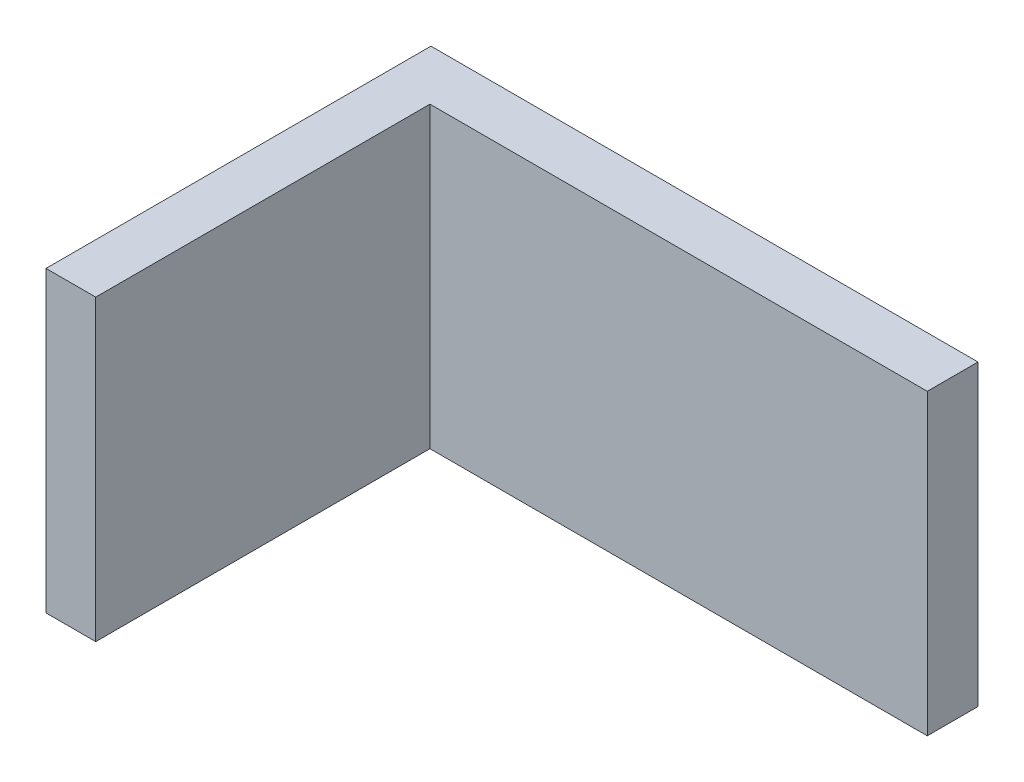
ISO-10303-21;
HEADER;
FILE_DESCRIPTION(('STEP AP214'),'2;1');
FILE_NAME('part.step','',(''),(''),'','','');
FILE_SCHEMA(('AUTOMOTIVE_DESIGN { 1 0 10303 214 1 1 1 1 }'));
ENDSEC;
DATA;
#1=APPLICATION_CONTEXT('core data for automotive mechanical design processes');
#2=APPLICATION_PROTOCOL_DEFINITION('international standard','automotive_design',2000,#1);
#3=PRODUCT_CONTEXT('',#1,'mechanical');
#4=PRODUCT('Part','Part','',(#3));
#5=PRODUCT_RELATED_PRODUCT_CATEGORY('part','',(#4));
#6=PRODUCT_DEFINITION_FORMATION('','',#4);
#7=PRODUCT_DEFINITION_CONTEXT('part definition',#1,'design');
#8=PRODUCT_DEFINITION('design','',#6,#7);
#9=PRODUCT_DEFINITION_SHAPE('','',#8);
#10=(LENGTH_UNIT() NAMED_UNIT(*) SI_UNIT(.MILLI.,.METRE.));
#11=(NAMED_UNIT(*) PLANE_ANGLE_UNIT() SI_UNIT($,.RADIAN.));
#12=(NAMED_UNIT(*) SI_UNIT($,.STERADIAN.) SOLID_ANGLE_UNIT());
#13=UNCERTAINTY_MEASURE_WITH_UNIT(LENGTH_MEASURE(1.E-05),#10,'distance_accuracy_value','');
#14=(GEOMETRIC_REPRESENTATION_CONTEXT(3) GLOBAL_UNCERTAINTY_ASSIGNED_CONTEXT((#13)) GLOBAL_UNIT_ASSIGNED_CONTEXT((#10,
#11,#12)) REPRESENTATION_CONTEXT('',''));
#15=CARTESIAN_POINT('',(0.,0.,0.));
#16=DIRECTION('',(0.,0.,1.));
#17=DIRECTION('',(1.,0.,0.));
#18=AXIS2_PLACEMENT_3D('',#15,#16,#17);
#19=CARTESIAN_POINT('',(-4.55,2.1,0.));
#20=DIRECTION('',(0.,-1.,0.));
#21=DIRECTION('',(0.,0.,1.));
#22=AXIS2_PLACEMENT_3D('',#19,#20,#21);
#23=PLANE('',#22);
#24=DIRECTION('',(-1.,0.,0.));
#25=VECTOR('',#24,1.);
#26=CARTESIAN_POINT('',(-4.,2.1,0.));
#27=LINE('',#26,#25);
#28=CARTESIAN_POINT('',(-4.,2.1,0.));
#29=VERTEX_POINT('',#28);
#30=CARTESIAN_POINT('',(-4.55,2.1,0.));
#31=VERTEX_POINT('',#30);
#32=EDGE_CURVE('E11',#29,#31,#27,.T.);
#33=ORIENTED_EDGE('',*,*,#32,.F.);
#34=DIRECTION('',(0.,0.,-1.));
#35=VECTOR('',#34,1.);
#36=CARTESIAN_POINT('',(-4.,2.1,0.051));
#37=LINE('',#36,#35);
#38=CARTESIAN_POINT('',(-4.,2.1,0.051));
#39=VERTEX_POINT('',#38);
#40=EDGE_CURVE('E24',#39,#29,#37,.T.);
#41=ORIENTED_EDGE('',*,*,#40,.F.);
#42=DIRECTION('',(1.,0.,0.));
#43=VECTOR('',#42,1.);
#44=CARTESIAN_POINT('',(-4.5,2.1,0.051));
#45=LINE('',#44,#43);
#46=CARTESIAN_POINT('',(-4.5,2.1,0.051));
#47=VERTEX_POINT('',#46);
#48=EDGE_CURVE('E87',#47,#39,#45,.T.);
#49=ORIENTED_EDGE('',*,*,#48,.F.);
#50=DIRECTION('',(0.,0.,-1.));
#51=VECTOR('',#50,1.);
#52=CARTESIAN_POINT('',(-4.5,2.1,0.387));
#53=LINE('',#52,#51);
#54=CARTESIAN_POINT('',(-4.5,2.1,0.387));
#55=VERTEX_POINT('',#54);
#56=EDGE_CURVE('E114',#55,#47,#53,.T.);
#57=ORIENTED_EDGE('',*,*,#56,.F.);
#58=DIRECTION('',(1.,0.,0.));
#59=VECTOR('',#58,1.);
#60=CARTESIAN_POINT('',(-4.55,2.1,0.387));
#61=LINE('',#60,#59);
#62=CARTESIAN_POINT('',(-4.55,2.1,0.387));
#63=VERTEX_POINT('',#62);
#64=EDGE_CURVE('E111',#63,#55,#61,.T.);
#65=ORIENTED_EDGE('',*,*,#64,.F.);
#66=DIRECTION('',(0.,0.,1.));
#67=VECTOR('',#66,1.);
#68=CARTESIAN_POINT('',(-4.55,2.1,0.));
#69=LINE('',#68,#67);
#70=EDGE_CURVE('E108',#31,#63,#69,.T.);
#71=ORIENTED_EDGE('',*,*,#70,.F.);
#72=EDGE_LOOP('',(#33,#41,#49,#57,#65,#71));
#73=FACE_BOUND('',#72,.T.);
#74=ADVANCED_FACE('F17',(#73),#23,.T.);
#75=CARTESIAN_POINT('',(-4.,2.4,0.));
#76=DIRECTION('',(0.,1.,0.));
#77=DIRECTION('',(0.,0.,1.));
#78=AXIS2_PLACEMENT_3D('',#75,#76,#77);
#79=PLANE('',#78);
#80=DIRECTION('',(1.,0.,0.));
#81=VECTOR('',#80,1.);
#82=CARTESIAN_POINT('',(-4.55,2.4,0.));
#83=LINE('',#82,#81);
#84=CARTESIAN_POINT('',(-4.55,2.4,0.));
#85=VERTEX_POINT('',#84);
#86=CARTESIAN_POINT('',(-4.,2.4,0.));
#87=VERTEX_POINT('',#86);
#88=EDGE_CURVE('E106',#85,#87,#83,.T.);
#89=ORIENTED_EDGE('',*,*,#88,.F.);
#90=DIRECTION('',(0.,0.,-1.));
#91=VECTOR('',#90,1.);
#92=CARTESIAN_POINT('',(-4.55,2.4,0.387));
#93=LINE('',#92,#91);
#94=CARTESIAN_POINT('',(-4.55,2.4,0.387));
#95=VERTEX_POINT('',#94);
#96=EDGE_CURVE('E103',#95,#85,#93,.T.);
#97=ORIENTED_EDGE('',*,*,#96,.F.);
#98=DIRECTION('',(-1.,0.,0.));
#99=VECTOR('',#98,1.);
#100=CARTESIAN_POINT('',(-4.5,2.4,0.387));
#101=LINE('',#100,#99);
#102=CARTESIAN_POINT('',(-4.5,2.4,0.387));
#103=VERTEX_POINT('',#102);
#104=EDGE_CURVE('E100',#103,#95,#101,.T.);
#105=ORIENTED_EDGE('',*,*,#104,.F.);
#106=DIRECTION('',(0.,0.,1.));
#107=VECTOR('',#106,1.);
#108=CARTESIAN_POINT('',(-4.5,2.4,0.051));
#109=LINE('',#108,#107);
#110=CARTESIAN_POINT('',(-4.5,2.4,0.051));
#111=VERTEX_POINT('',#110);
#112=EDGE_CURVE('E72',#111,#103,#109,.T.);
#113=ORIENTED_EDGE('',*,*,#112,.F.);
#114=DIRECTION('',(-1.,0.,0.));
#115=VECTOR('',#114,1.);
#116=CARTESIAN_POINT('',(-4.,2.4,0.051));
#117=LINE('',#116,#115);
#118=CARTESIAN_POINT('',(-4.,2.4,0.051));
#119=VERTEX_POINT('',#118);
#120=EDGE_CURVE('E66',#119,#111,#117,.T.);
#121=ORIENTED_EDGE('',*,*,#120,.F.);
#122=DIRECTION('',(0.,0.,1.));
#123=VECTOR('',#122,1.);
#124=CARTESIAN_POINT('',(-4.,2.4,0.));
#125=LINE('',#124,#123);
#126=EDGE_CURVE('E69',#87,#119,#125,.T.);
#127=ORIENTED_EDGE('',*,*,#126,.F.);
#128=EDGE_LOOP('',(#89,#97,#105,#113,#121,#127));
#129=FACE_BOUND('',#128,.T.);
#130=ADVANCED_FACE('F68',(#129),#79,.T.);
#131=CARTESIAN_POINT('',(-4.55,2.1,0.387));
#132=DIRECTION('',(0.,0.,1.));
#133=DIRECTION('',(0.,1.,0.));
#134=AXIS2_PLACEMENT_3D('',#131,#132,#133);
#135=PLANE('',#134);
#136=ORIENTED_EDGE('',*,*,#64,.T.);
#137=DIRECTION('',(0.,-1.,0.));
#138=VECTOR('',#137,1.);
#139=CARTESIAN_POINT('',(-4.5,2.4,0.387));
#140=LINE('',#139,#138);
#141=EDGE_CURVE('E83',#103,#55,#140,.T.);
#142=ORIENTED_EDGE('',*,*,#141,.F.);
#143=ORIENTED_EDGE('',*,*,#104,.T.);
#144=DIRECTION('',(0.,1.,0.));
#145=VECTOR('',#144,1.);
#146=CARTESIAN_POINT('',(-4.55,2.1,0.387));
#147=LINE('',#146,#145);
#148=EDGE_CURVE('E88',#63,#95,#147,.T.);
#149=ORIENTED_EDGE('',*,*,#148,.F.);
#150=EDGE_LOOP('',(#136,#142,#143,#149));
#151=FACE_BOUND('',#150,.T.);
#152=ADVANCED_FACE('F125',(#151),#135,.T.);
#153=CARTESIAN_POINT('',(-4.5,2.1,0.051));
#154=DIRECTION('',(0.,0.,1.));
#155=DIRECTION('',(0.,1.,0.));
#156=AXIS2_PLACEMENT_3D('',#153,#154,#155);
#157=PLANE('',#156);
#158=ORIENTED_EDGE('',*,*,#48,.T.);
#159=DIRECTION('',(0.,-1.,0.));
#160=VECTOR('',#159,1.);
#161=CARTESIAN_POINT('',(-4.,2.4,0.051));
#162=LINE('',#161,#160);
#163=EDGE_CURVE('E81',#119,#39,#162,.T.);
#164=ORIENTED_EDGE('',*,*,#163,.F.);
#165=ORIENTED_EDGE('',*,*,#120,.T.);
#166=DIRECTION('',(0.,1.,0.));
#167=VECTOR('',#166,1.);
#168=CARTESIAN_POINT('',(-4.5,2.1,0.051));
#169=LINE('',#168,#167);
#170=EDGE_CURVE('E89',#47,#111,#169,.T.);
#171=ORIENTED_EDGE('',*,*,#170,.F.);
#172=EDGE_LOOP('',(#158,#164,#165,#171));
#173=FACE_BOUND('',#172,.T.);
#174=ADVANCED_FACE('F86',(#173),#157,.T.);
#175=CARTESIAN_POINT('',(-4.55,2.4,0.));
#176=DIRECTION('',(-1.,0.,0.));
#177=DIRECTION('',(0.,0.,1.));
#178=AXIS2_PLACEMENT_3D('',#175,#176,#177);
#179=PLANE('',#178);
#180=DIRECTION('',(0.,1.,0.));
#181=VECTOR('',#180,1.);
#182=CARTESIAN_POINT('',(-4.55,2.1,0.));
#183=LINE('',#182,#181);
#184=EDGE_CURVE('E93',#31,#85,#183,.T.);
#185=ORIENTED_EDGE('',*,*,#184,.F.);
#186=ORIENTED_EDGE('',*,*,#70,.T.);
#187=ORIENTED_EDGE('',*,*,#148,.T.);
#188=ORIENTED_EDGE('',*,*,#96,.T.);
#189=EDGE_LOOP('',(#185,#186,#187,#188));
#190=FACE_BOUND('',#189,.T.);
#191=ADVANCED_FACE('F121',(#190),#179,.T.);
#192=CARTESIAN_POINT('',(-4.,2.1,0.));
#193=DIRECTION('',(1.,0.,0.));
#194=DIRECTION('',(0.,0.,1.));
#195=AXIS2_PLACEMENT_3D('',#192,#193,#194);
#196=PLANE('',#195);
#197=DIRECTION('',(0.,-1.,0.));
#198=VECTOR('',#197,1.);
#199=CARTESIAN_POINT('',(-4.,2.4,0.));
#200=LINE('',#199,#198);
#201=EDGE_CURVE('E82',#87,#29,#200,.T.);
#202=ORIENTED_EDGE('',*,*,#201,.F.);
#203=ORIENTED_EDGE('',*,*,#126,.T.);
#204=ORIENTED_EDGE('',*,*,#163,.T.);
#205=ORIENTED_EDGE('',*,*,#40,.T.);
#206=EDGE_LOOP('',(#202,#203,#204,#205));
#207=FACE_BOUND('',#206,.T.);
#208=ADVANCED_FACE('F80',(#207),#196,.T.);
#209=CARTESIAN_POINT('',(-4.5,2.1,0.051));
#210=DIRECTION('',(1.,0.,0.));
#211=DIRECTION('',(0.,0.,1.));
#212=AXIS2_PLACEMENT_3D('',#209,#210,#211);
#213=PLANE('',#212);
#214=ORIENTED_EDGE('',*,*,#170,.T.);
#215=ORIENTED_EDGE('',*,*,#112,.T.);
#216=ORIENTED_EDGE('',*,*,#141,.T.);
#217=ORIENTED_EDGE('',*,*,#56,.T.);
#218=EDGE_LOOP('',(#214,#215,#216,#217));
#219=FACE_BOUND('',#218,.T.);
#220=ADVANCED_FACE('F127',(#219),#213,.T.);
#221=CARTESIAN_POINT('',(-4.55,2.4,0.));
#222=DIRECTION('',(0.,0.,-1.));
#223=DIRECTION('',(0.,1.,0.));
#224=AXIS2_PLACEMENT_3D('',#221,#222,#223);
#225=PLANE('',#224);
#226=ORIENTED_EDGE('',*,*,#88,.T.);
#227=ORIENTED_EDGE('',*,*,#201,.T.);
#228=ORIENTED_EDGE('',*,*,#32,.T.);
#229=ORIENTED_EDGE('',*,*,#184,.T.);
#230=EDGE_LOOP('',(#226,#227,#228,#229));
#231=FACE_BOUND('',#230,.T.);
#232=ADVANCED_FACE('F117',(#231),#225,.T.);
#233=CLOSED_SHELL('',(#74,#130,#152,#174,#191,#208,#220,#232));
#234=MANIFOLD_SOLID_BREP('B1',#233);
#235=ADVANCED_BREP_SHAPE_REPRESENTATION('',(#18,#234),#14);
#236=SHAPE_DEFINITION_REPRESENTATION(#9,#235);
ENDSEC;
END-ISO-10303-21;
